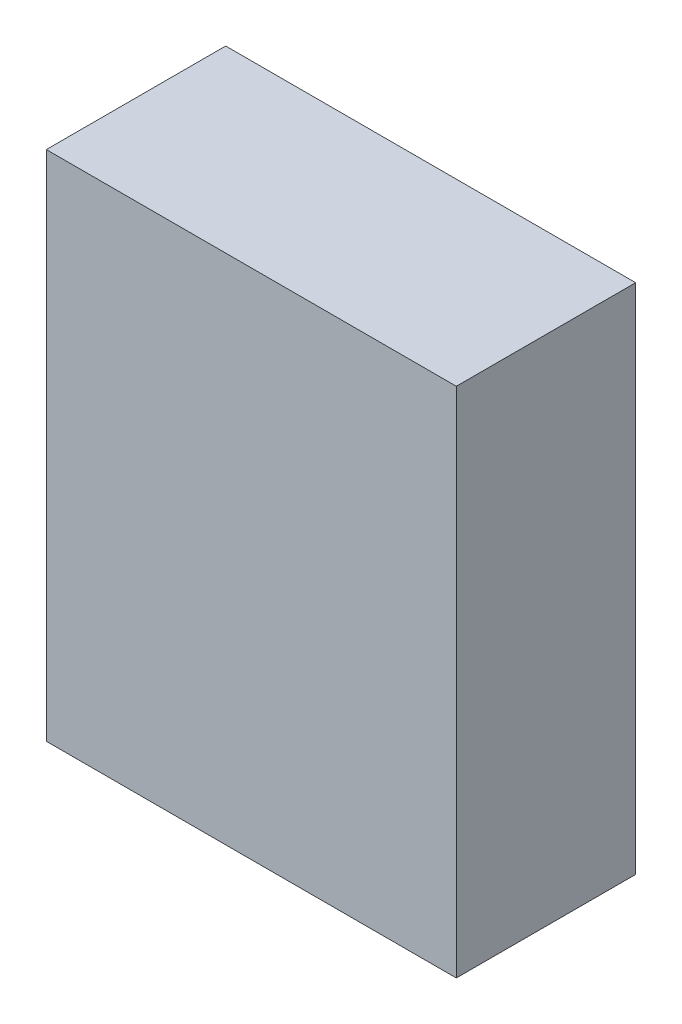
ISO-10303-21;
HEADER;
FILE_DESCRIPTION(('STEP AP214'),'2;1');
FILE_NAME('part.step','',(''),(''),'','','');
FILE_SCHEMA(('AUTOMOTIVE_DESIGN { 1 0 10303 214 1 1 1 1 }'));
ENDSEC;
DATA;
#1=APPLICATION_CONTEXT('core data for automotive mechanical design processes');
#2=APPLICATION_PROTOCOL_DEFINITION('international standard','automotive_design',2000,#1);
#3=PRODUCT_CONTEXT('',#1,'mechanical');
#4=PRODUCT('Part','Part','',(#3));
#5=PRODUCT_RELATED_PRODUCT_CATEGORY('part','',(#4));
#6=PRODUCT_DEFINITION_FORMATION('','',#4);
#7=PRODUCT_DEFINITION_CONTEXT('part definition',#1,'design');
#8=PRODUCT_DEFINITION('design','',#6,#7);
#9=PRODUCT_DEFINITION_SHAPE('','',#8);
#10=(LENGTH_UNIT() NAMED_UNIT(*) SI_UNIT(.MILLI.,.METRE.));
#11=(NAMED_UNIT(*) PLANE_ANGLE_UNIT() SI_UNIT($,.RADIAN.));
#12=(NAMED_UNIT(*) SI_UNIT($,.STERADIAN.) SOLID_ANGLE_UNIT());
#13=UNCERTAINTY_MEASURE_WITH_UNIT(LENGTH_MEASURE(1.E-05),#10,'distance_accuracy_value','');
#14=(GEOMETRIC_REPRESENTATION_CONTEXT(3) GLOBAL_UNCERTAINTY_ASSIGNED_CONTEXT((#13)) GLOBAL_UNIT_ASSIGNED_CONTEXT((#10,
#11,#12)) REPRESENTATION_CONTEXT('',''));
#15=CARTESIAN_POINT('',(0.,0.,0.));
#16=DIRECTION('',(0.,0.,1.));
#17=DIRECTION('',(1.,0.,0.));
#18=AXIS2_PLACEMENT_3D('',#15,#16,#17);
#19=CARTESIAN_POINT('',(-2.00000108,2.50000008,1.74999904));
#20=DIRECTION('',(0.,0.,1.));
#21=DIRECTION('',(1.,0.,0.));
#22=AXIS2_PLACEMENT_3D('',#19,#20,#21);
#23=PLANE('',#22);
#24=DIRECTION('',(0.,1.,0.));
#25=VECTOR('',#24,1.);
#26=CARTESIAN_POINT('',(2.00000108,2.50000008,1.74999904));
#27=LINE('',#26,#25);
#28=CARTESIAN_POINT('',(2.00000108,2.50000008,1.74999904));
#29=VERTEX_POINT('',#28);
#30=CARTESIAN_POINT('',(2.00000108,-2.50000008,1.74999904));
#31=VERTEX_POINT('',#30);
#32=EDGE_CURVE('E53',#29,#31,#27,.F.);
#33=ORIENTED_EDGE('',*,*,#32,.F.);
#34=DIRECTION('',(1.,0.,0.));
#35=VECTOR('',#34,1.);
#36=CARTESIAN_POINT('',(-2.00000108,2.50000008,1.74999904));
#37=LINE('',#36,#35);
#38=CARTESIAN_POINT('',(-2.00000108,2.50000008,1.74999904));
#39=VERTEX_POINT('',#38);
#40=EDGE_CURVE('E68',#39,#29,#37,.T.);
#41=ORIENTED_EDGE('',*,*,#40,.F.);
#42=DIRECTION('',(0.,1.,0.));
#43=VECTOR('',#42,1.);
#44=CARTESIAN_POINT('',(-2.00000108,-2.50000008,1.74999904));
#45=LINE('',#44,#43);
#46=CARTESIAN_POINT('',(-2.00000108,-2.50000008,1.74999904));
#47=VERTEX_POINT('',#46);
#48=EDGE_CURVE('E20',#47,#39,#45,.T.);
#49=ORIENTED_EDGE('',*,*,#48,.F.);
#50=DIRECTION('',(1.,0.,0.));
#51=VECTOR('',#50,1.);
#52=CARTESIAN_POINT('',(2.00000108,-2.50000008,1.74999904));
#53=LINE('',#52,#51);
#54=EDGE_CURVE('E58',#31,#47,#53,.F.);
#55=ORIENTED_EDGE('',*,*,#54,.F.);
#56=EDGE_LOOP('',(#33,#41,#49,#55));
#57=FACE_BOUND('',#56,.T.);
#58=ADVANCED_FACE('F17',(#57),#23,.T.);
#59=CARTESIAN_POINT('',(-2.00000108,-2.50000008,0.));
#60=DIRECTION('',(-1.,0.,0.));
#61=DIRECTION('',(0.,0.,1.));
#62=AXIS2_PLACEMENT_3D('',#59,#60,#61);
#63=PLANE('',#62);
#64=DIRECTION('',(0.,0.,1.));
#65=VECTOR('',#64,1.);
#66=CARTESIAN_POINT('',(-2.00000108,2.50000008,0.));
#67=LINE('',#66,#65);
#68=CARTESIAN_POINT('',(-2.00000108,2.50000008,0.));
#69=VERTEX_POINT('',#68);
#70=EDGE_CURVE('E79',#69,#39,#67,.T.);
#71=ORIENTED_EDGE('',*,*,#70,.F.);
#72=DIRECTION('',(0.,1.,0.));
#73=VECTOR('',#72,1.);
#74=CARTESIAN_POINT('',(-2.00000108,2.50000008,0.));
#75=LINE('',#74,#73);
#76=CARTESIAN_POINT('',(-2.00000108,-2.50000008,0.));
#77=VERTEX_POINT('',#76);
#78=EDGE_CURVE('E74',#69,#77,#75,.F.);
#79=ORIENTED_EDGE('',*,*,#78,.T.);
#80=DIRECTION('',(0.,0.,-1.));
#81=VECTOR('',#80,1.);
#82=CARTESIAN_POINT('',(-2.00000108,-2.50000008,0.));
#83=LINE('',#82,#81);
#84=EDGE_CURVE('E63',#47,#77,#83,.T.);
#85=ORIENTED_EDGE('',*,*,#84,.F.);
#86=ORIENTED_EDGE('',*,*,#48,.T.);
#87=EDGE_LOOP('',(#71,#79,#85,#86));
#88=FACE_BOUND('',#87,.T.);
#89=ADVANCED_FACE('F73',(#88),#63,.T.);
#90=CARTESIAN_POINT('',(2.00000108,-2.50000008,0.));
#91=DIRECTION('',(0.,-1.,0.));
#92=DIRECTION('',(0.,0.,-1.));
#93=AXIS2_PLACEMENT_3D('',#90,#91,#92);
#94=PLANE('',#93);
#95=ORIENTED_EDGE('',*,*,#84,.T.);
#96=DIRECTION('',(1.,0.,0.));
#97=VECTOR('',#96,1.);
#98=CARTESIAN_POINT('',(-2.00000108,-2.50000008,0.));
#99=LINE('',#98,#97);
#100=CARTESIAN_POINT('',(2.00000108,-2.50000008,0.));
#101=VERTEX_POINT('',#100);
#102=EDGE_CURVE('E84',#77,#101,#99,.T.);
#103=ORIENTED_EDGE('',*,*,#102,.T.);
#104=DIRECTION('',(0.,0.,-1.));
#105=VECTOR('',#104,1.);
#106=CARTESIAN_POINT('',(2.00000108,-2.50000008,0.));
#107=LINE('',#106,#105);
#108=EDGE_CURVE('E65',#31,#101,#107,.T.);
#109=ORIENTED_EDGE('',*,*,#108,.F.);
#110=ORIENTED_EDGE('',*,*,#54,.T.);
#111=EDGE_LOOP('',(#95,#103,#109,#110));
#112=FACE_BOUND('',#111,.T.);
#113=ADVANCED_FACE('F60',(#112),#94,.T.);
#114=CARTESIAN_POINT('',(2.00000108,2.50000008,0.));
#115=DIRECTION('',(1.,0.,0.));
#116=DIRECTION('',(0.,0.,-1.));
#117=AXIS2_PLACEMENT_3D('',#114,#115,#116);
#118=PLANE('',#117);
#119=ORIENTED_EDGE('',*,*,#108,.T.);
#120=DIRECTION('',(0.,1.,0.));
#121=VECTOR('',#120,1.);
#122=CARTESIAN_POINT('',(2.00000108,2.50000008,0.));
#123=LINE('',#122,#121);
#124=CARTESIAN_POINT('',(2.00000108,2.50000008,0.));
#125=VERTEX_POINT('',#124);
#126=EDGE_CURVE('E26',#101,#125,#123,.T.);
#127=ORIENTED_EDGE('',*,*,#126,.T.);
#128=DIRECTION('',(0.,0.,1.));
#129=VECTOR('',#128,1.);
#130=CARTESIAN_POINT('',(2.00000108,2.50000008,0.));
#131=LINE('',#130,#129);
#132=EDGE_CURVE('E34',#29,#125,#131,.F.);
#133=ORIENTED_EDGE('',*,*,#132,.F.);
#134=ORIENTED_EDGE('',*,*,#32,.T.);
#135=EDGE_LOOP('',(#119,#127,#133,#134));
#136=FACE_BOUND('',#135,.T.);
#137=ADVANCED_FACE('F88',(#136),#118,.T.);
#138=CARTESIAN_POINT('',(-2.00000108,2.50000008,0.));
#139=DIRECTION('',(0.,1.,0.));
#140=DIRECTION('',(0.,0.,1.));
#141=AXIS2_PLACEMENT_3D('',#138,#139,#140);
#142=PLANE('',#141);
#143=ORIENTED_EDGE('',*,*,#132,.T.);
#144=DIRECTION('',(1.,0.,0.));
#145=VECTOR('',#144,1.);
#146=CARTESIAN_POINT('',(-2.00000108,2.50000008,0.));
#147=LINE('',#146,#145);
#148=EDGE_CURVE('E11',#125,#69,#147,.F.);
#149=ORIENTED_EDGE('',*,*,#148,.T.);
#150=ORIENTED_EDGE('',*,*,#70,.T.);
#151=ORIENTED_EDGE('',*,*,#40,.T.);
#152=EDGE_LOOP('',(#143,#149,#150,#151));
#153=FACE_BOUND('',#152,.T.);
#154=ADVANCED_FACE('F91',(#153),#142,.T.);
#155=CARTESIAN_POINT('',(-2.00000108,2.50000008,0.));
#156=DIRECTION('',(0.,0.,1.));
#157=DIRECTION('',(1.,0.,0.));
#158=AXIS2_PLACEMENT_3D('',#155,#156,#157);
#159=PLANE('',#158);
#160=ORIENTED_EDGE('',*,*,#126,.F.);
#161=ORIENTED_EDGE('',*,*,#102,.F.);
#162=ORIENTED_EDGE('',*,*,#78,.F.);
#163=ORIENTED_EDGE('',*,*,#148,.F.);
#164=EDGE_LOOP('',(#160,#161,#162,#163));
#165=FACE_BOUND('',#164,.T.);
#166=ADVANCED_FACE('F90',(#165),#159,.F.);
#167=CLOSED_SHELL('',(#58,#89,#113,#137,#154,#166));
#168=MANIFOLD_SOLID_BREP('B1',#167);
#169=ADVANCED_BREP_SHAPE_REPRESENTATION('',(#18,#168),#14);
#170=SHAPE_DEFINITION_REPRESENTATION(#9,#169);
ENDSEC;
END-ISO-10303-21;
